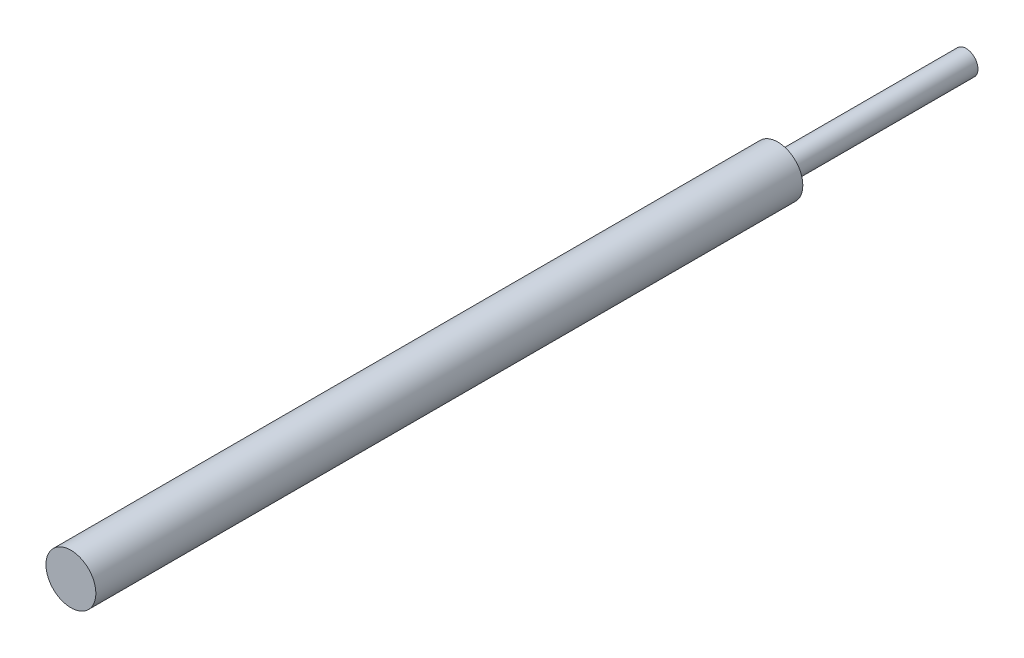
ISO-10303-21;
HEADER;
FILE_DESCRIPTION(('STEP AP214'),'2;1');
FILE_NAME('part.step','',(''),(''),'','','');
FILE_SCHEMA(('AUTOMOTIVE_DESIGN { 1 0 10303 214 1 1 1 1 }'));
ENDSEC;
DATA;
#1=APPLICATION_CONTEXT('core data for automotive mechanical design processes');
#2=APPLICATION_PROTOCOL_DEFINITION('international standard','automotive_design',2000,#1);
#3=PRODUCT_CONTEXT('',#1,'mechanical');
#4=PRODUCT('Part','Part','',(#3));
#5=PRODUCT_RELATED_PRODUCT_CATEGORY('part','',(#4));
#6=PRODUCT_DEFINITION_FORMATION('','',#4);
#7=PRODUCT_DEFINITION_CONTEXT('part definition',#1,'design');
#8=PRODUCT_DEFINITION('design','',#6,#7);
#9=PRODUCT_DEFINITION_SHAPE('','',#8);
#10=(LENGTH_UNIT() NAMED_UNIT(*) SI_UNIT(.MILLI.,.METRE.));
#11=(NAMED_UNIT(*) PLANE_ANGLE_UNIT() SI_UNIT($,.RADIAN.));
#12=(NAMED_UNIT(*) SI_UNIT($,.STERADIAN.) SOLID_ANGLE_UNIT());
#13=UNCERTAINTY_MEASURE_WITH_UNIT(LENGTH_MEASURE(1.E-05),#10,'distance_accuracy_value','');
#14=(GEOMETRIC_REPRESENTATION_CONTEXT(3) GLOBAL_UNCERTAINTY_ASSIGNED_CONTEXT((#13)) GLOBAL_UNIT_ASSIGNED_CONTEXT((#10,
#11,#12)) REPRESENTATION_CONTEXT('',''));
#15=CARTESIAN_POINT('',(0.,0.,0.));
#16=DIRECTION('',(0.,0.,1.));
#17=DIRECTION('',(1.,0.,0.));
#18=AXIS2_PLACEMENT_3D('',#15,#16,#17);
#19=CARTESIAN_POINT('',(0.,0.,45.974));
#20=DIRECTION('',(0.,0.,-1.));
#21=DIRECTION('',(-1.,0.,0.));
#22=AXIS2_PLACEMENT_3D('',#19,#20,#21);
#23=CYLINDRICAL_SURFACE('',#22,2.921);
#24=CARTESIAN_POINT('',(0.,0.,45.974));
#25=DIRECTION('',(0.,0.,1.));
#26=DIRECTION('',(1.,0.,0.));
#27=AXIS2_PLACEMENT_3D('',#24,#25,#26);
#28=CIRCLE('',#27,2.921);
#29=CARTESIAN_POINT('',(2.921,0.,45.974));
#30=VERTEX_POINT('',#29);
#31=EDGE_CURVE('E10',#30,#30,#28,.T.);
#32=ORIENTED_EDGE('',*,*,#31,.F.);
#33=EDGE_LOOP('',(#32));
#34=FACE_BOUND('',#33,.T.);
#35=CARTESIAN_POINT('',(0.,0.,0.));
#36=DIRECTION('',(0.,0.,1.));
#37=DIRECTION('',(1.,0.,0.));
#38=AXIS2_PLACEMENT_3D('',#35,#36,#37);
#39=CIRCLE('',#38,2.921);
#40=CARTESIAN_POINT('',(2.921,0.,0.));
#41=VERTEX_POINT('',#40);
#42=EDGE_CURVE('E33',#41,#41,#39,.T.);
#43=ORIENTED_EDGE('',*,*,#42,.T.);
#44=EDGE_LOOP('',(#43));
#45=FACE_BOUND('',#44,.T.);
#46=ADVANCED_FACE('F30',(#34,#45),#23,.T.);
#47=CARTESIAN_POINT('',(0.,0.,0.));
#48=DIRECTION('',(0.,0.,1.));
#49=DIRECTION('',(1.,0.,0.));
#50=AXIS2_PLACEMENT_3D('',#47,#48,#49);
#51=PLANE('',#50);
#52=ORIENTED_EDGE('',*,*,#42,.F.);
#53=EDGE_LOOP('',(#52));
#54=FACE_BOUND('',#53,.T.);
#55=ADVANCED_FACE('F58',(#54),#51,.F.);
#56=CARTESIAN_POINT('',(0.,0.,45.974));
#57=DIRECTION('',(0.,0.,1.));
#58=DIRECTION('',(1.,0.,0.));
#59=AXIS2_PLACEMENT_3D('',#56,#57,#58);
#60=PLANE('',#59);
#61=CARTESIAN_POINT('',(0.,0.,45.974));
#62=DIRECTION('',(0.,0.,1.));
#63=DIRECTION('',(1.,0.,0.));
#64=AXIS2_PLACEMENT_3D('',#61,#62,#63);
#65=CIRCLE('',#64,6.096);
#66=CARTESIAN_POINT('',(6.096,0.,45.974));
#67=VERTEX_POINT('',#66);
#68=EDGE_CURVE('E42',#67,#67,#65,.T.);
#69=ORIENTED_EDGE('',*,*,#68,.F.);
#70=EDGE_LOOP('',(#69));
#71=FACE_BOUND('',#70,.T.);
#72=ORIENTED_EDGE('',*,*,#31,.T.);
#73=EDGE_LOOP('',(#72));
#74=FACE_BOUND('',#73,.T.);
#75=ADVANCED_FACE('F53',(#71,#74),#60,.F.);
#76=CARTESIAN_POINT('',(0.,0.,218.694));
#77=DIRECTION('',(0.,0.,-1.));
#78=DIRECTION('',(-1.,0.,0.));
#79=AXIS2_PLACEMENT_3D('',#76,#77,#78);
#80=CYLINDRICAL_SURFACE('',#79,6.096);
#81=CARTESIAN_POINT('',(0.,0.,218.694));
#82=DIRECTION('',(0.,0.,1.));
#83=DIRECTION('',(1.,0.,0.));
#84=AXIS2_PLACEMENT_3D('',#81,#82,#83);
#85=CIRCLE('',#84,6.096);
#86=CARTESIAN_POINT('',(6.096,0.,218.694));
#87=VERTEX_POINT('',#86);
#88=EDGE_CURVE('E40',#87,#87,#85,.T.);
#89=ORIENTED_EDGE('',*,*,#88,.F.);
#90=EDGE_LOOP('',(#89));
#91=FACE_BOUND('',#90,.T.);
#92=ORIENTED_EDGE('',*,*,#68,.T.);
#93=EDGE_LOOP('',(#92));
#94=FACE_BOUND('',#93,.T.);
#95=ADVANCED_FACE('F50',(#91,#94),#80,.T.);
#96=CARTESIAN_POINT('',(0.,0.,218.694));
#97=DIRECTION('',(0.,0.,1.));
#98=DIRECTION('',(1.,0.,0.));
#99=AXIS2_PLACEMENT_3D('',#96,#97,#98);
#100=PLANE('',#99);
#101=ORIENTED_EDGE('',*,*,#88,.T.);
#102=EDGE_LOOP('',(#101));
#103=FACE_BOUND('',#102,.T.);
#104=ADVANCED_FACE('F48',(#103),#100,.T.);
#105=CLOSED_SHELL('',(#46,#55,#75,#95,#104));
#106=MANIFOLD_SOLID_BREP('B2',#105);
#107=ADVANCED_BREP_SHAPE_REPRESENTATION('',(#18,#106),#14);
#108=SHAPE_DEFINITION_REPRESENTATION(#9,#107);
ENDSEC;
END-ISO-10303-21;
